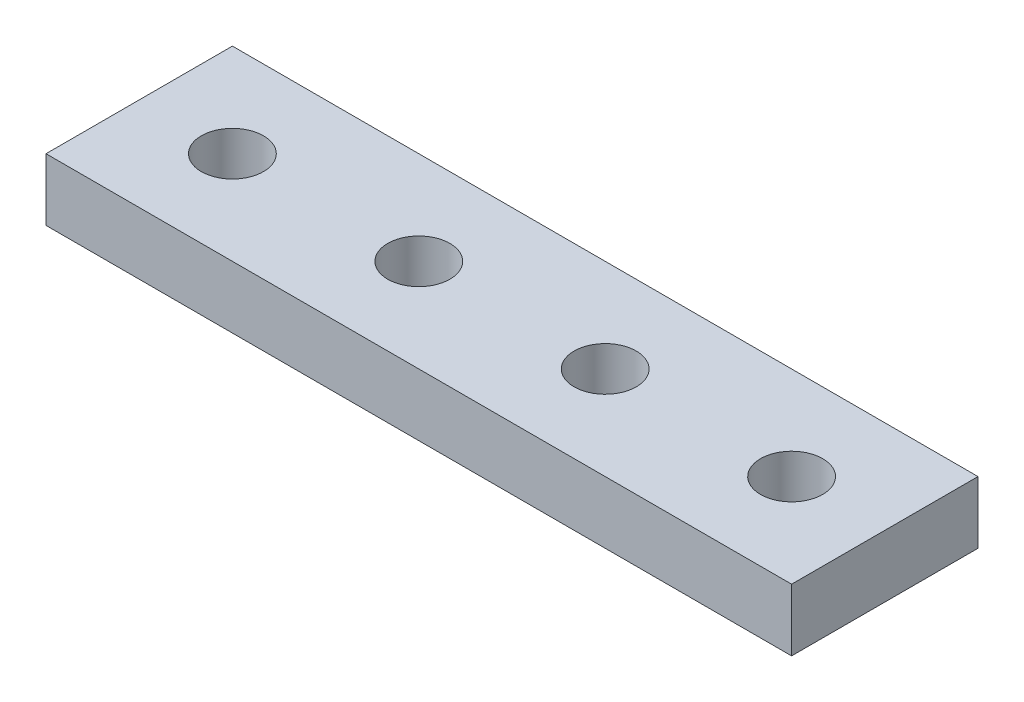
ISO-10303-21;
HEADER;
FILE_DESCRIPTION(('STEP AP214'),'2;1');
FILE_NAME('part.step','',(''),(''),'','','');
FILE_SCHEMA(('AUTOMOTIVE_DESIGN { 1 0 10303 214 1 1 1 1 }'));
ENDSEC;
DATA;
#1=APPLICATION_CONTEXT('core data for automotive mechanical design processes');
#2=APPLICATION_PROTOCOL_DEFINITION('international standard','automotive_design',2000,#1);
#3=PRODUCT_CONTEXT('',#1,'mechanical');
#4=PRODUCT('Part','Part','',(#3));
#5=PRODUCT_RELATED_PRODUCT_CATEGORY('part','',(#4));
#6=PRODUCT_DEFINITION_FORMATION('','',#4);
#7=PRODUCT_DEFINITION_CONTEXT('part definition',#1,'design');
#8=PRODUCT_DEFINITION('design','',#6,#7);
#9=PRODUCT_DEFINITION_SHAPE('','',#8);
#10=(LENGTH_UNIT() NAMED_UNIT(*) SI_UNIT(.MILLI.,.METRE.));
#11=(NAMED_UNIT(*) PLANE_ANGLE_UNIT() SI_UNIT($,.RADIAN.));
#12=(NAMED_UNIT(*) SI_UNIT($,.STERADIAN.) SOLID_ANGLE_UNIT());
#13=UNCERTAINTY_MEASURE_WITH_UNIT(LENGTH_MEASURE(1.E-05),#10,'distance_accuracy_value','');
#14=(GEOMETRIC_REPRESENTATION_CONTEXT(3) GLOBAL_UNCERTAINTY_ASSIGNED_CONTEXT((#13)) GLOBAL_UNIT_ASSIGNED_CONTEXT((#10,
#11,#12)) REPRESENTATION_CONTEXT('',''));
#15=CARTESIAN_POINT('',(0.,0.,0.));
#16=DIRECTION('',(0.,0.,1.));
#17=DIRECTION('',(1.,0.,0.));
#18=AXIS2_PLACEMENT_3D('',#15,#16,#17);
#19=CARTESIAN_POINT('',(0.,10.,0.));
#20=DIRECTION('',(0.,-1.,0.));
#21=DIRECTION('',(0.,0.,-1.));
#22=AXIS2_PLACEMENT_3D('',#19,#20,#21);
#23=PLANE('',#22);
#24=DIRECTION('',(0.,0.,1.));
#25=VECTOR('',#24,1.);
#26=CARTESIAN_POINT('',(0.,10.,0.));
#27=LINE('',#26,#25);
#28=CARTESIAN_POINT('',(0.,10.,-30.));
#29=VERTEX_POINT('',#28);
#30=CARTESIAN_POINT('',(0.,10.,0.));
#31=VERTEX_POINT('',#30);
#32=EDGE_CURVE('E85',#29,#31,#27,.T.);
#33=ORIENTED_EDGE('',*,*,#32,.T.);
#34=DIRECTION('',(1.,0.,0.));
#35=VECTOR('',#34,1.);
#36=CARTESIAN_POINT('',(0.,10.,0.));
#37=LINE('',#36,#35);
#38=CARTESIAN_POINT('',(120.,10.,0.));
#39=VERTEX_POINT('',#38);
#40=EDGE_CURVE('E80',#31,#39,#37,.T.);
#41=ORIENTED_EDGE('',*,*,#40,.T.);
#42=DIRECTION('',(0.,0.,-1.));
#43=VECTOR('',#42,1.);
#44=CARTESIAN_POINT('',(120.,10.,0.));
#45=LINE('',#44,#43);
#46=CARTESIAN_POINT('',(120.,10.,-30.));
#47=VERTEX_POINT('',#46);
#48=EDGE_CURVE('E83',#39,#47,#45,.T.);
#49=ORIENTED_EDGE('',*,*,#48,.T.);
#50=DIRECTION('',(-1.,0.,0.));
#51=VECTOR('',#50,1.);
#52=CARTESIAN_POINT('',(0.,10.,-30.));
#53=LINE('',#52,#51);
#54=EDGE_CURVE('E50',#47,#29,#53,.T.);
#55=ORIENTED_EDGE('',*,*,#54,.T.);
#56=EDGE_LOOP('',(#33,#41,#49,#55));
#57=FACE_BOUND('',#56,.T.);
#58=CARTESIAN_POINT('',(15.,10.,-15.));
#59=DIRECTION('',(0.,1.,0.));
#60=DIRECTION('',(0.,0.,1.));
#61=AXIS2_PLACEMENT_3D('',#58,#59,#60);
#62=CIRCLE('',#61,5.);
#63=CARTESIAN_POINT('',(15.,10.,-10.));
#64=VERTEX_POINT('',#63);
#65=EDGE_CURVE('E100',#64,#64,#62,.T.);
#66=ORIENTED_EDGE('',*,*,#65,.F.);
#67=EDGE_LOOP('',(#66));
#68=FACE_BOUND('',#67,.T.);
#69=CARTESIAN_POINT('',(45.,10.,-15.));
#70=DIRECTION('',(0.,1.,0.));
#71=DIRECTION('',(0.,0.,1.));
#72=AXIS2_PLACEMENT_3D('',#69,#70,#71);
#73=CIRCLE('',#72,5.);
#74=CARTESIAN_POINT('',(45.,10.,-10.));
#75=VERTEX_POINT('',#74);
#76=EDGE_CURVE('E115',#75,#75,#73,.T.);
#77=ORIENTED_EDGE('',*,*,#76,.F.);
#78=EDGE_LOOP('',(#77));
#79=FACE_BOUND('',#78,.T.);
#80=CARTESIAN_POINT('',(75.,10.,-15.));
#81=DIRECTION('',(0.,1.,0.));
#82=DIRECTION('',(0.,0.,1.));
#83=AXIS2_PLACEMENT_3D('',#80,#81,#82);
#84=CIRCLE('',#83,5.);
#85=CARTESIAN_POINT('',(75.,10.,-9.99999999999999));
#86=VERTEX_POINT('',#85);
#87=EDGE_CURVE('E121',#86,#86,#84,.T.);
#88=ORIENTED_EDGE('',*,*,#87,.F.);
#89=EDGE_LOOP('',(#88));
#90=FACE_BOUND('',#89,.T.);
#91=CARTESIAN_POINT('',(105.,10.,-15.));
#92=DIRECTION('',(0.,1.,0.));
#93=DIRECTION('',(0.,0.,1.));
#94=AXIS2_PLACEMENT_3D('',#91,#92,#93);
#95=CIRCLE('',#94,5.);
#96=CARTESIAN_POINT('',(105.,10.,-9.99999999999999));
#97=VERTEX_POINT('',#96);
#98=EDGE_CURVE('E127',#97,#97,#95,.T.);
#99=ORIENTED_EDGE('',*,*,#98,.F.);
#100=EDGE_LOOP('',(#99));
#101=FACE_BOUND('',#100,.T.);
#102=ADVANCED_FACE('F33',(#57,#68,#79,#90,#101),#23,.F.);
#103=CARTESIAN_POINT('',(0.,0.,0.));
#104=DIRECTION('',(0.,-1.,0.));
#105=DIRECTION('',(0.,0.,-1.));
#106=AXIS2_PLACEMENT_3D('',#103,#104,#105);
#107=PLANE('',#106);
#108=CARTESIAN_POINT('',(75.,0.,-15.));
#109=DIRECTION('',(0.,1.,0.));
#110=DIRECTION('',(0.,0.,1.));
#111=AXIS2_PLACEMENT_3D('',#108,#109,#110);
#112=CIRCLE('',#111,5.);
#113=CARTESIAN_POINT('',(75.,0.,-9.99999999999999));
#114=VERTEX_POINT('',#113);
#115=EDGE_CURVE('E124',#114,#114,#112,.T.);
#116=ORIENTED_EDGE('',*,*,#115,.T.);
#117=EDGE_LOOP('',(#116));
#118=FACE_BOUND('',#117,.T.);
#119=CARTESIAN_POINT('',(15.,0.,-15.));
#120=DIRECTION('',(0.,1.,0.));
#121=DIRECTION('',(0.,0.,1.));
#122=AXIS2_PLACEMENT_3D('',#119,#120,#121);
#123=CIRCLE('',#122,5.);
#124=CARTESIAN_POINT('',(15.,0.,-10.));
#125=VERTEX_POINT('',#124);
#126=EDGE_CURVE('E112',#125,#125,#123,.T.);
#127=ORIENTED_EDGE('',*,*,#126,.T.);
#128=EDGE_LOOP('',(#127));
#129=FACE_BOUND('',#128,.T.);
#130=DIRECTION('',(0.,0.,1.));
#131=VECTOR('',#130,1.);
#132=CARTESIAN_POINT('',(0.,0.,0.));
#133=LINE('',#132,#131);
#134=CARTESIAN_POINT('',(0.,0.,-30.));
#135=VERTEX_POINT('',#134);
#136=CARTESIAN_POINT('',(0.,0.,0.));
#137=VERTEX_POINT('',#136);
#138=EDGE_CURVE('E97',#135,#137,#133,.T.);
#139=ORIENTED_EDGE('',*,*,#138,.F.);
#140=DIRECTION('',(-1.,0.,0.));
#141=VECTOR('',#140,1.);
#142=CARTESIAN_POINT('',(0.,0.,-30.));
#143=LINE('',#142,#141);
#144=CARTESIAN_POINT('',(120.,0.,-30.));
#145=VERTEX_POINT('',#144);
#146=EDGE_CURVE('E73',#145,#135,#143,.T.);
#147=ORIENTED_EDGE('',*,*,#146,.F.);
#148=DIRECTION('',(0.,0.,-1.));
#149=VECTOR('',#148,1.);
#150=CARTESIAN_POINT('',(120.,0.,0.));
#151=LINE('',#150,#149);
#152=CARTESIAN_POINT('',(120.,0.,0.));
#153=VERTEX_POINT('',#152);
#154=EDGE_CURVE('E67',#153,#145,#151,.T.);
#155=ORIENTED_EDGE('',*,*,#154,.F.);
#156=DIRECTION('',(1.,0.,0.));
#157=VECTOR('',#156,1.);
#158=CARTESIAN_POINT('',(0.,0.,0.));
#159=LINE('',#158,#157);
#160=EDGE_CURVE('E89',#137,#153,#159,.T.);
#161=ORIENTED_EDGE('',*,*,#160,.F.);
#162=EDGE_LOOP('',(#139,#147,#155,#161));
#163=FACE_BOUND('',#162,.T.);
#164=CARTESIAN_POINT('',(45.,0.,-15.));
#165=DIRECTION('',(0.,1.,0.));
#166=DIRECTION('',(0.,0.,1.));
#167=AXIS2_PLACEMENT_3D('',#164,#165,#166);
#168=CIRCLE('',#167,5.);
#169=CARTESIAN_POINT('',(45.,0.,-10.));
#170=VERTEX_POINT('',#169);
#171=EDGE_CURVE('E118',#170,#170,#168,.T.);
#172=ORIENTED_EDGE('',*,*,#171,.T.);
#173=EDGE_LOOP('',(#172));
#174=FACE_BOUND('',#173,.T.);
#175=CARTESIAN_POINT('',(105.,0.,-15.));
#176=DIRECTION('',(0.,1.,0.));
#177=DIRECTION('',(0.,0.,1.));
#178=AXIS2_PLACEMENT_3D('',#175,#176,#177);
#179=CIRCLE('',#178,5.);
#180=CARTESIAN_POINT('',(105.,0.,-9.99999999999999));
#181=VERTEX_POINT('',#180);
#182=EDGE_CURVE('E130',#181,#181,#179,.T.);
#183=ORIENTED_EDGE('',*,*,#182,.T.);
#184=EDGE_LOOP('',(#183));
#185=FACE_BOUND('',#184,.T.);
#186=ADVANCED_FACE('F108',(#118,#129,#163,#174,#185),#107,.T.);
#187=CARTESIAN_POINT('',(0.,10.,0.));
#188=DIRECTION('',(1.,0.,0.));
#189=DIRECTION('',(0.,0.,-1.));
#190=AXIS2_PLACEMENT_3D('',#187,#188,#189);
#191=PLANE('',#190);
#192=ORIENTED_EDGE('',*,*,#138,.T.);
#193=DIRECTION('',(0.,-1.,0.));
#194=VECTOR('',#193,1.);
#195=CARTESIAN_POINT('',(0.,10.,0.));
#196=LINE('',#195,#194);
#197=EDGE_CURVE('E11',#31,#137,#196,.T.);
#198=ORIENTED_EDGE('',*,*,#197,.F.);
#199=ORIENTED_EDGE('',*,*,#32,.F.);
#200=DIRECTION('',(0.,-1.,0.));
#201=VECTOR('',#200,1.);
#202=CARTESIAN_POINT('',(0.,10.,-30.));
#203=LINE('',#202,#201);
#204=EDGE_CURVE('E93',#29,#135,#203,.T.);
#205=ORIENTED_EDGE('',*,*,#204,.T.);
#206=EDGE_LOOP('',(#192,#198,#199,#205));
#207=FACE_BOUND('',#206,.T.);
#208=ADVANCED_FACE('F35',(#207),#191,.F.);
#209=CARTESIAN_POINT('',(0.,10.,0.));
#210=DIRECTION('',(0.,0.,-1.));
#211=DIRECTION('',(-1.,0.,0.));
#212=AXIS2_PLACEMENT_3D('',#209,#210,#211);
#213=PLANE('',#212);
#214=ORIENTED_EDGE('',*,*,#160,.T.);
#215=DIRECTION('',(0.,-1.,0.));
#216=VECTOR('',#215,1.);
#217=CARTESIAN_POINT('',(120.,10.,0.));
#218=LINE('',#217,#216);
#219=EDGE_CURVE('E42',#39,#153,#218,.T.);
#220=ORIENTED_EDGE('',*,*,#219,.F.);
#221=ORIENTED_EDGE('',*,*,#40,.F.);
#222=ORIENTED_EDGE('',*,*,#197,.T.);
#223=EDGE_LOOP('',(#214,#220,#221,#222));
#224=FACE_BOUND('',#223,.T.);
#225=ADVANCED_FACE('F88',(#224),#213,.F.);
#226=CARTESIAN_POINT('',(120.,10.,0.));
#227=DIRECTION('',(-1.,0.,0.));
#228=DIRECTION('',(0.,0.,1.));
#229=AXIS2_PLACEMENT_3D('',#226,#227,#228);
#230=PLANE('',#229);
#231=ORIENTED_EDGE('',*,*,#154,.T.);
#232=DIRECTION('',(0.,-1.,0.));
#233=VECTOR('',#232,1.);
#234=CARTESIAN_POINT('',(120.,10.,-30.));
#235=LINE('',#234,#233);
#236=EDGE_CURVE('E90',#47,#145,#235,.T.);
#237=ORIENTED_EDGE('',*,*,#236,.F.);
#238=ORIENTED_EDGE('',*,*,#48,.F.);
#239=ORIENTED_EDGE('',*,*,#219,.T.);
#240=EDGE_LOOP('',(#231,#237,#238,#239));
#241=FACE_BOUND('',#240,.T.);
#242=ADVANCED_FACE('F91',(#241),#230,.F.);
#243=CARTESIAN_POINT('',(0.,10.,-30.));
#244=DIRECTION('',(0.,0.,1.));
#245=DIRECTION('',(1.,0.,0.));
#246=AXIS2_PLACEMENT_3D('',#243,#244,#245);
#247=PLANE('',#246);
#248=ORIENTED_EDGE('',*,*,#146,.T.);
#249=ORIENTED_EDGE('',*,*,#204,.F.);
#250=ORIENTED_EDGE('',*,*,#54,.F.);
#251=ORIENTED_EDGE('',*,*,#236,.T.);
#252=EDGE_LOOP('',(#248,#249,#250,#251));
#253=FACE_BOUND('',#252,.T.);
#254=ADVANCED_FACE('F105',(#253),#247,.F.);
#255=CARTESIAN_POINT('',(15.,10.,-15.));
#256=DIRECTION('',(0.,-1.,0.));
#257=DIRECTION('',(0.,0.,-1.));
#258=AXIS2_PLACEMENT_3D('',#255,#256,#257);
#259=CYLINDRICAL_SURFACE('',#258,5.);
#260=ORIENTED_EDGE('',*,*,#65,.T.);
#261=EDGE_LOOP('',(#260));
#262=FACE_BOUND('',#261,.T.);
#263=ORIENTED_EDGE('',*,*,#126,.F.);
#264=EDGE_LOOP('',(#263));
#265=FACE_BOUND('',#264,.T.);
#266=ADVANCED_FACE('F147',(#262,#265),#259,.F.);
#267=CARTESIAN_POINT('',(45.,10.,-15.));
#268=DIRECTION('',(0.,-1.,0.));
#269=DIRECTION('',(0.,0.,-1.));
#270=AXIS2_PLACEMENT_3D('',#267,#268,#269);
#271=CYLINDRICAL_SURFACE('',#270,5.);
#272=ORIENTED_EDGE('',*,*,#76,.T.);
#273=EDGE_LOOP('',(#272));
#274=FACE_BOUND('',#273,.T.);
#275=ORIENTED_EDGE('',*,*,#171,.F.);
#276=EDGE_LOOP('',(#275));
#277=FACE_BOUND('',#276,.T.);
#278=ADVANCED_FACE('F193',(#274,#277),#271,.F.);
#279=CARTESIAN_POINT('',(75.,10.,-15.));
#280=DIRECTION('',(0.,-1.,0.));
#281=DIRECTION('',(0.,0.,-1.));
#282=AXIS2_PLACEMENT_3D('',#279,#280,#281);
#283=CYLINDRICAL_SURFACE('',#282,5.);
#284=ORIENTED_EDGE('',*,*,#87,.T.);
#285=EDGE_LOOP('',(#284));
#286=FACE_BOUND('',#285,.T.);
#287=ORIENTED_EDGE('',*,*,#115,.F.);
#288=EDGE_LOOP('',(#287));
#289=FACE_BOUND('',#288,.T.);
#290=ADVANCED_FACE('F201',(#286,#289),#283,.F.);
#291=CARTESIAN_POINT('',(105.,10.,-15.));
#292=DIRECTION('',(0.,-1.,0.));
#293=DIRECTION('',(0.,0.,-1.));
#294=AXIS2_PLACEMENT_3D('',#291,#292,#293);
#295=CYLINDRICAL_SURFACE('',#294,5.);
#296=ORIENTED_EDGE('',*,*,#98,.T.);
#297=EDGE_LOOP('',(#296));
#298=FACE_BOUND('',#297,.T.);
#299=ORIENTED_EDGE('',*,*,#182,.F.);
#300=EDGE_LOOP('',(#299));
#301=FACE_BOUND('',#300,.T.);
#302=ADVANCED_FACE('F136',(#298,#301),#295,.F.);
#303=CLOSED_SHELL('',(#102,#186,#208,#225,#242,#254,#266,#278,#290,#302));
#304=MANIFOLD_SOLID_BREP('B2',#303);
#305=ADVANCED_BREP_SHAPE_REPRESENTATION('',(#18,#304),#14);
#306=SHAPE_DEFINITION_REPRESENTATION(#9,#305);
ENDSEC;
END-ISO-10303-21;
